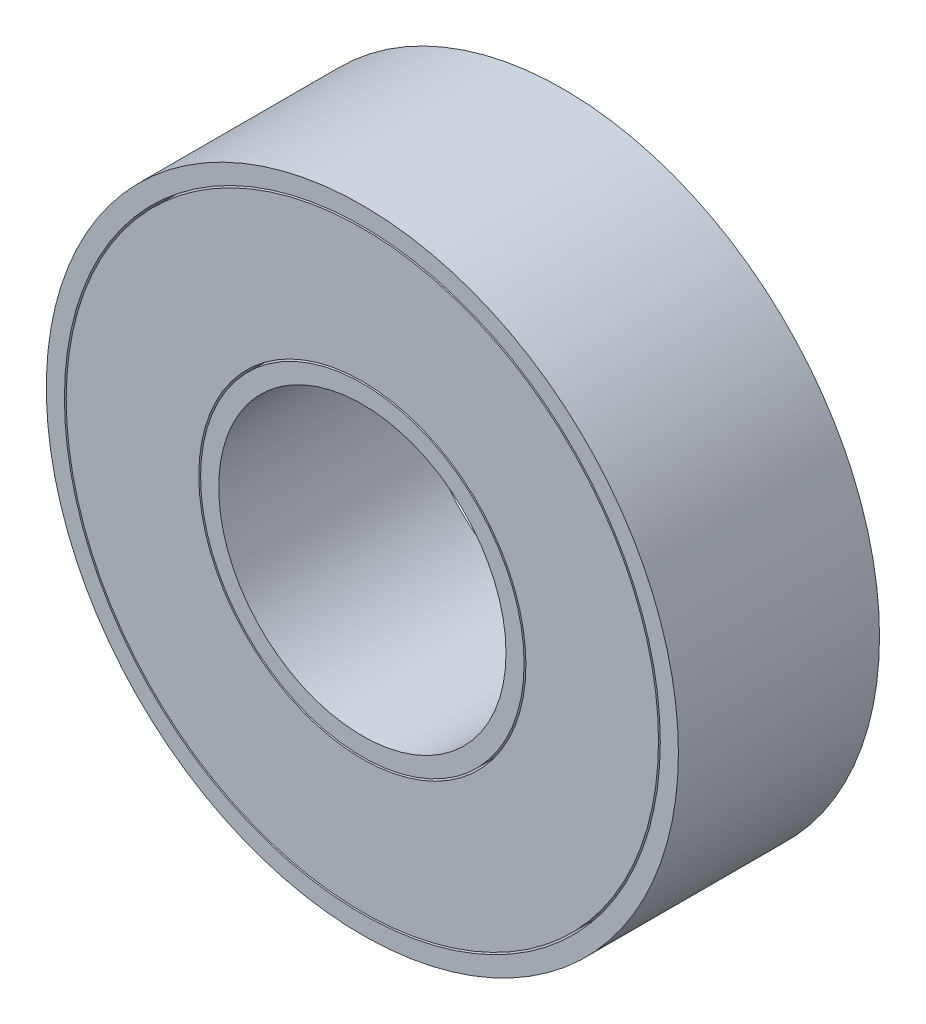
ISO-10303-21;
HEADER;
FILE_DESCRIPTION(('STEP AP214'),'2;1');
FILE_NAME('part.step','',(''),(''),'','','');
FILE_SCHEMA(('AUTOMOTIVE_DESIGN { 1 0 10303 214 1 1 1 1 }'));
ENDSEC;
DATA;
#1=APPLICATION_CONTEXT('core data for automotive mechanical design processes');
#2=APPLICATION_PROTOCOL_DEFINITION('international standard','automotive_design',2000,#1);
#3=PRODUCT_CONTEXT('',#1,'mechanical');
#4=PRODUCT('Part','Part','',(#3));
#5=PRODUCT_RELATED_PRODUCT_CATEGORY('part','',(#4));
#6=PRODUCT_DEFINITION_FORMATION('','',#4);
#7=PRODUCT_DEFINITION_CONTEXT('part definition',#1,'design');
#8=PRODUCT_DEFINITION('design','',#6,#7);
#9=PRODUCT_DEFINITION_SHAPE('','',#8);
#10=(LENGTH_UNIT() NAMED_UNIT(*) SI_UNIT(.MILLI.,.METRE.));
#11=(NAMED_UNIT(*) PLANE_ANGLE_UNIT() SI_UNIT($,.RADIAN.));
#12=(NAMED_UNIT(*) SI_UNIT($,.STERADIAN.) SOLID_ANGLE_UNIT());
#13=UNCERTAINTY_MEASURE_WITH_UNIT(LENGTH_MEASURE(1.E-05),#10,'distance_accuracy_value','');
#14=(GEOMETRIC_REPRESENTATION_CONTEXT(3) GLOBAL_UNCERTAINTY_ASSIGNED_CONTEXT((#13)) GLOBAL_UNIT_ASSIGNED_CONTEXT((#10,
#11,#12)) REPRESENTATION_CONTEXT('',''));
#15=CARTESIAN_POINT('',(0.,0.,0.));
#16=DIRECTION('',(0.,0.,1.));
#17=DIRECTION('',(1.,0.,0.));
#18=AXIS2_PLACEMENT_3D('',#15,#16,#17);
#19=CARTESIAN_POINT('',(0.,0.,11.112));
#20=DIRECTION('',(0.,0.,1.));
#21=DIRECTION('',(1.,0.,0.));
#22=AXIS2_PLACEMENT_3D('',#19,#20,#21);
#23=PLANE('',#22);
#24=CARTESIAN_POINT('',(0.,0.,11.112));
#25=DIRECTION('',(0.,0.,1.));
#26=DIRECTION('',(1.,0.,0.));
#27=AXIS2_PLACEMENT_3D('',#24,#25,#26);
#28=CIRCLE('',#27,16.4625);
#29=CARTESIAN_POINT('',(16.4625,0.,11.112));
#30=VERTEX_POINT('',#29);
#31=EDGE_CURVE('E55',#30,#30,#28,.T.);
#32=ORIENTED_EDGE('',*,*,#31,.F.);
#33=EDGE_LOOP('',(#32));
#34=FACE_BOUND('',#33,.T.);
#35=CARTESIAN_POINT('',(0.,0.,11.112));
#36=DIRECTION('',(0.,0.,1.));
#37=DIRECTION('',(1.,0.,0.));
#38=AXIS2_PLACEMENT_3D('',#35,#36,#37);
#39=CIRCLE('',#38,17.4625);
#40=CARTESIAN_POINT('',(17.4625,0.,11.112));
#41=VERTEX_POINT('',#40);
#42=EDGE_CURVE('E63',#41,#41,#39,.T.);
#43=ORIENTED_EDGE('',*,*,#42,.T.);
#44=EDGE_LOOP('',(#43));
#45=FACE_BOUND('',#44,.T.);
#46=ADVANCED_FACE('F49',(#34,#45),#23,.T.);
#47=CARTESIAN_POINT('',(0.,0.,0.));
#48=DIRECTION('',(0.,0.,1.));
#49=DIRECTION('',(1.,0.,0.));
#50=AXIS2_PLACEMENT_3D('',#47,#48,#49);
#51=PLANE('',#50);
#52=CARTESIAN_POINT('',(0.,0.,0.));
#53=DIRECTION('',(0.,0.,-1.));
#54=DIRECTION('',(-1.,0.,0.));
#55=AXIS2_PLACEMENT_3D('',#52,#53,#54);
#56=CIRCLE('',#55,16.4625);
#57=CARTESIAN_POINT('',(-16.4625,0.,0.));
#58=VERTEX_POINT('',#57);
#59=EDGE_CURVE('E12',#58,#58,#56,.T.);
#60=ORIENTED_EDGE('',*,*,#59,.F.);
#61=EDGE_LOOP('',(#60));
#62=FACE_BOUND('',#61,.T.);
#63=CARTESIAN_POINT('',(0.,0.,0.));
#64=DIRECTION('',(0.,0.,1.));
#65=DIRECTION('',(1.,0.,0.));
#66=AXIS2_PLACEMENT_3D('',#63,#64,#65);
#67=CIRCLE('',#66,17.4625);
#68=CARTESIAN_POINT('',(17.4625,0.,0.));
#69=VERTEX_POINT('',#68);
#70=EDGE_CURVE('E59',#69,#69,#67,.T.);
#71=ORIENTED_EDGE('',*,*,#70,.F.);
#72=EDGE_LOOP('',(#71));
#73=FACE_BOUND('',#72,.T.);
#74=ADVANCED_FACE('F74',(#62,#73),#51,.F.);
#75=CARTESIAN_POINT('',(0.,0.,11.112));
#76=DIRECTION('',(0.,0.,-1.));
#77=DIRECTION('',(-1.,0.,0.));
#78=AXIS2_PLACEMENT_3D('',#75,#76,#77);
#79=CYLINDRICAL_SURFACE('',#78,17.4625);
#80=ORIENTED_EDGE('',*,*,#42,.F.);
#81=EDGE_LOOP('',(#80));
#82=FACE_BOUND('',#81,.T.);
#83=ORIENTED_EDGE('',*,*,#70,.T.);
#84=EDGE_LOOP('',(#83));
#85=FACE_BOUND('',#84,.T.);
#86=ADVANCED_FACE('F70',(#82,#85),#79,.T.);
#87=CARTESIAN_POINT('',(0.,0.,20.5));
#88=DIRECTION('',(0.,0.,-1.));
#89=DIRECTION('',(-1.,0.,0.));
#90=AXIS2_PLACEMENT_3D('',#87,#88,#89);
#91=CYLINDRICAL_SURFACE('',#90,16.4625);
#92=ORIENTED_EDGE('',*,*,#31,.T.);
#93=EDGE_LOOP('',(#92));
#94=FACE_BOUND('',#93,.T.);
#95=ORIENTED_EDGE('',*,*,#59,.T.);
#96=EDGE_LOOP('',(#95));
#97=FACE_BOUND('',#96,.T.);
#98=ADVANCED_FACE('F73',(#94,#97),#91,.F.);
#99=CLOSED_SHELL('',(#46,#74,#86,#98));
#100=MANIFOLD_SOLID_BREP('B2',#99);
#101=CARTESIAN_POINT('',(0.,0.,0.));
#102=DIRECTION('',(0.,0.,1.));
#103=DIRECTION('',(1.,0.,0.));
#104=AXIS2_PLACEMENT_3D('',#101,#102,#103);
#105=PLANE('',#104);
#106=CARTESIAN_POINT('',(0.,0.,0.));
#107=DIRECTION('',(0.,0.,-1.));
#108=DIRECTION('',(-1.,0.,0.));
#109=AXIS2_PLACEMENT_3D('',#106,#107,#108);
#110=CIRCLE('',#109,9.0375);
#111=CARTESIAN_POINT('',(-9.0375,0.,0.));
#112=VERTEX_POINT('',#111);
#113=EDGE_CURVE('E125',#112,#112,#110,.T.);
#114=ORIENTED_EDGE('',*,*,#113,.F.);
#115=EDGE_LOOP('',(#114));
#116=FACE_BOUND('',#115,.T.);
#117=CARTESIAN_POINT('',(0.,0.,0.));
#118=DIRECTION('',(0.,0.,-1.));
#119=DIRECTION('',(-1.,0.,0.));
#120=AXIS2_PLACEMENT_3D('',#117,#118,#119);
#121=CIRCLE('',#120,16.3625);
#122=CARTESIAN_POINT('',(-16.3625,0.,0.));
#123=VERTEX_POINT('',#122);
#124=EDGE_CURVE('E121',#123,#123,#121,.T.);
#125=ORIENTED_EDGE('',*,*,#124,.T.);
#126=EDGE_LOOP('',(#125));
#127=FACE_BOUND('',#126,.T.);
#128=ADVANCED_FACE('F117',(#116,#127),#105,.F.);
#129=CARTESIAN_POINT('',(0.,0.,20.5));
#130=DIRECTION('',(0.,0.,-1.));
#131=DIRECTION('',(-1.,0.,0.));
#132=AXIS2_PLACEMENT_3D('',#129,#130,#131);
#133=CYLINDRICAL_SURFACE('',#132,9.0375);
#134=CARTESIAN_POINT('',(0.,0.,11.112));
#135=DIRECTION('',(0.,0.,1.));
#136=DIRECTION('',(1.,0.,0.));
#137=AXIS2_PLACEMENT_3D('',#134,#135,#136);
#138=CIRCLE('',#137,9.0375);
#139=CARTESIAN_POINT('',(9.0375,0.,11.112));
#140=VERTEX_POINT('',#139);
#141=EDGE_CURVE('E130',#140,#140,#138,.T.);
#142=ORIENTED_EDGE('',*,*,#141,.T.);
#143=EDGE_LOOP('',(#142));
#144=FACE_BOUND('',#143,.T.);
#145=ORIENTED_EDGE('',*,*,#113,.T.);
#146=EDGE_LOOP('',(#145));
#147=FACE_BOUND('',#146,.T.);
#148=ADVANCED_FACE('F141',(#144,#147),#133,.F.);
#149=CARTESIAN_POINT('',(0.,0.,20.5));
#150=DIRECTION('',(0.,0.,-1.));
#151=DIRECTION('',(-1.,0.,0.));
#152=AXIS2_PLACEMENT_3D('',#149,#150,#151);
#153=CYLINDRICAL_SURFACE('',#152,16.3625);
#154=CARTESIAN_POINT('',(0.,0.,11.112));
#155=DIRECTION('',(0.,0.,1.));
#156=DIRECTION('',(1.,0.,0.));
#157=AXIS2_PLACEMENT_3D('',#154,#155,#156);
#158=CIRCLE('',#157,16.3625);
#159=CARTESIAN_POINT('',(16.3625,0.,11.112));
#160=VERTEX_POINT('',#159);
#161=EDGE_CURVE('E48',#160,#160,#158,.T.);
#162=ORIENTED_EDGE('',*,*,#161,.F.);
#163=EDGE_LOOP('',(#162));
#164=FACE_BOUND('',#163,.T.);
#165=ORIENTED_EDGE('',*,*,#124,.F.);
#166=EDGE_LOOP('',(#165));
#167=FACE_BOUND('',#166,.T.);
#168=ADVANCED_FACE('F139',(#164,#167),#153,.T.);
#169=CARTESIAN_POINT('',(0.,0.,11.112));
#170=DIRECTION('',(0.,0.,1.));
#171=DIRECTION('',(1.,0.,0.));
#172=AXIS2_PLACEMENT_3D('',#169,#170,#171);
#173=PLANE('',#172);
#174=ORIENTED_EDGE('',*,*,#141,.F.);
#175=EDGE_LOOP('',(#174));
#176=FACE_BOUND('',#175,.T.);
#177=ORIENTED_EDGE('',*,*,#161,.T.);
#178=EDGE_LOOP('',(#177));
#179=FACE_BOUND('',#178,.T.);
#180=ADVANCED_FACE('F119',(#176,#179),#173,.T.);
#181=CLOSED_SHELL('',(#128,#148,#168,#180));
#182=MANIFOLD_SOLID_BREP('B7',#181);
#183=CARTESIAN_POINT('',(0.,0.,11.112));
#184=DIRECTION('',(0.,0.,1.));
#185=DIRECTION('',(1.,0.,0.));
#186=AXIS2_PLACEMENT_3D('',#183,#184,#185);
#187=PLANE('',#186);
#188=CARTESIAN_POINT('',(0.,0.,11.112));
#189=DIRECTION('',(0.,0.,1.));
#190=DIRECTION('',(1.,0.,0.));
#191=AXIS2_PLACEMENT_3D('',#188,#189,#190);
#192=CIRCLE('',#191,7.9375);
#193=CARTESIAN_POINT('',(7.9375,0.,11.112));
#194=VERTEX_POINT('',#193);
#195=EDGE_CURVE('E116',#194,#194,#192,.T.);
#196=ORIENTED_EDGE('',*,*,#195,.F.);
#197=EDGE_LOOP('',(#196));
#198=FACE_BOUND('',#197,.T.);
#199=CARTESIAN_POINT('',(0.,0.,11.112));
#200=DIRECTION('',(0.,0.,1.));
#201=DIRECTION('',(1.,0.,0.));
#202=AXIS2_PLACEMENT_3D('',#199,#200,#201);
#203=CIRCLE('',#202,8.9375);
#204=CARTESIAN_POINT('',(8.9375,0.,11.112));
#205=VERTEX_POINT('',#204);
#206=EDGE_CURVE('E189',#205,#205,#203,.T.);
#207=ORIENTED_EDGE('',*,*,#206,.T.);
#208=EDGE_LOOP('',(#207));
#209=FACE_BOUND('',#208,.T.);
#210=ADVANCED_FACE('F178',(#198,#209),#187,.T.);
#211=CARTESIAN_POINT('',(0.,0.,11.112));
#212=DIRECTION('',(0.,0.,-1.));
#213=DIRECTION('',(-1.,0.,0.));
#214=AXIS2_PLACEMENT_3D('',#211,#212,#213);
#215=CYLINDRICAL_SURFACE('',#214,7.9375);
#216=ORIENTED_EDGE('',*,*,#195,.T.);
#217=EDGE_LOOP('',(#216));
#218=FACE_BOUND('',#217,.T.);
#219=CARTESIAN_POINT('',(0.,0.,0.));
#220=DIRECTION('',(0.,0.,1.));
#221=DIRECTION('',(1.,0.,0.));
#222=AXIS2_PLACEMENT_3D('',#219,#220,#221);
#223=CIRCLE('',#222,7.9375);
#224=CARTESIAN_POINT('',(7.9375,0.,0.));
#225=VERTEX_POINT('',#224);
#226=EDGE_CURVE('E182',#225,#225,#223,.T.);
#227=ORIENTED_EDGE('',*,*,#226,.F.);
#228=EDGE_LOOP('',(#227));
#229=FACE_BOUND('',#228,.T.);
#230=ADVANCED_FACE('F205',(#218,#229),#215,.F.);
#231=CARTESIAN_POINT('',(0.,0.,0.));
#232=DIRECTION('',(0.,0.,1.));
#233=DIRECTION('',(1.,0.,0.));
#234=AXIS2_PLACEMENT_3D('',#231,#232,#233);
#235=PLANE('',#234);
#236=ORIENTED_EDGE('',*,*,#226,.T.);
#237=EDGE_LOOP('',(#236));
#238=FACE_BOUND('',#237,.T.);
#239=CARTESIAN_POINT('',(0.,0.,0.));
#240=DIRECTION('',(0.,0.,-1.));
#241=DIRECTION('',(-1.,0.,0.));
#242=AXIS2_PLACEMENT_3D('',#239,#240,#241);
#243=CIRCLE('',#242,8.9375);
#244=CARTESIAN_POINT('',(-8.9375,0.,0.));
#245=VERTEX_POINT('',#244);
#246=EDGE_CURVE('E193',#245,#245,#243,.T.);
#247=ORIENTED_EDGE('',*,*,#246,.T.);
#248=EDGE_LOOP('',(#247));
#249=FACE_BOUND('',#248,.T.);
#250=ADVANCED_FACE('F180',(#238,#249),#235,.F.);
#251=CARTESIAN_POINT('',(0.,0.,20.5));
#252=DIRECTION('',(0.,0.,-1.));
#253=DIRECTION('',(-1.,0.,0.));
#254=AXIS2_PLACEMENT_3D('',#251,#252,#253);
#255=CYLINDRICAL_SURFACE('',#254,8.9375);
#256=ORIENTED_EDGE('',*,*,#206,.F.);
#257=EDGE_LOOP('',(#256));
#258=FACE_BOUND('',#257,.T.);
#259=ORIENTED_EDGE('',*,*,#246,.F.);
#260=EDGE_LOOP('',(#259));
#261=FACE_BOUND('',#260,.T.);
#262=ADVANCED_FACE('F198',(#258,#261),#255,.T.);
#263=CLOSED_SHELL('',(#210,#230,#250,#262));
#264=MANIFOLD_SOLID_BREP('B43',#263);
#265=ADVANCED_BREP_SHAPE_REPRESENTATION('',(#18,#100,#182,#264),#14);
#266=SHAPE_DEFINITION_REPRESENTATION(#9,#265);
ENDSEC;
END-ISO-10303-21;
